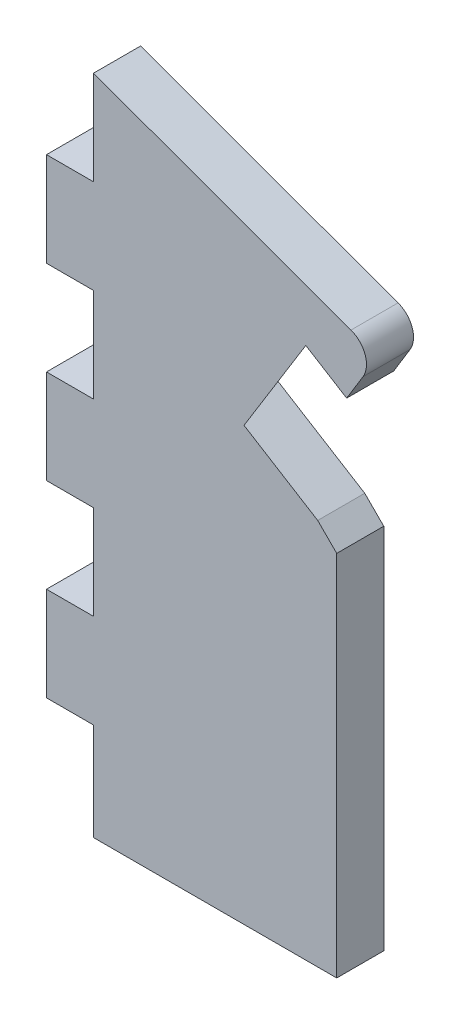
ISO-10303-21;
HEADER;
FILE_DESCRIPTION(('STEP AP214'),'2;1');
FILE_NAME('part.step','',(''),(''),'','','');
FILE_SCHEMA(('AUTOMOTIVE_DESIGN { 1 0 10303 214 1 1 1 1 }'));
ENDSEC;
DATA;
#1=APPLICATION_CONTEXT('core data for automotive mechanical design processes');
#2=APPLICATION_PROTOCOL_DEFINITION('international standard','automotive_design',2000,#1);
#3=PRODUCT_CONTEXT('',#1,'mechanical');
#4=PRODUCT('Part','Part','',(#3));
#5=PRODUCT_RELATED_PRODUCT_CATEGORY('part','',(#4));
#6=PRODUCT_DEFINITION_FORMATION('','',#4);
#7=PRODUCT_DEFINITION_CONTEXT('part definition',#1,'design');
#8=PRODUCT_DEFINITION('design','',#6,#7);
#9=PRODUCT_DEFINITION_SHAPE('','',#8);
#10=(LENGTH_UNIT() NAMED_UNIT(*) SI_UNIT(.MILLI.,.METRE.));
#11=(NAMED_UNIT(*) PLANE_ANGLE_UNIT() SI_UNIT($,.RADIAN.));
#12=(NAMED_UNIT(*) SI_UNIT($,.STERADIAN.) SOLID_ANGLE_UNIT());
#13=UNCERTAINTY_MEASURE_WITH_UNIT(LENGTH_MEASURE(1.E-05),#10,'distance_accuracy_value','');
#14=(GEOMETRIC_REPRESENTATION_CONTEXT(3) GLOBAL_UNCERTAINTY_ASSIGNED_CONTEXT((#13)) GLOBAL_UNIT_ASSIGNED_CONTEXT((#10,
#11,#12)) REPRESENTATION_CONTEXT('',''));
#15=CARTESIAN_POINT('',(0.,0.,0.));
#16=DIRECTION('',(0.,0.,1.));
#17=DIRECTION('',(1.,0.,0.));
#18=AXIS2_PLACEMENT_3D('',#15,#16,#17);
#19=CARTESIAN_POINT('',(0.,140.724589222245,0.));
#20=DIRECTION('',(0.,0.,-1.));
#21=DIRECTION('',(-1.,0.,0.));
#22=AXIS2_PLACEMENT_3D('',#19,#20,#21);
#23=PLANE('',#22);
#24=DIRECTION('',(0.525491223211028,0.850799021113787,0.));
#25=VECTOR('',#24,1.);
#26=CARTESIAN_POINT('',(52.2872206694648,114.912677761406,-8.88178419700125E-13));
#27=LINE('',#26,#25);
#28=CARTESIAN_POINT('',(39.1499400891891,93.6427022335608,-7.7715611723761E-13));
#29=VERTEX_POINT('',#28);
#30=CARTESIAN_POINT('',(52.2872206694648,114.912677761406,-8.88178419700125E-13));
#31=VERTEX_POINT('',#30);
#32=EDGE_CURVE('E209',#29,#31,#27,.T.);
#33=ORIENTED_EDGE('',*,*,#32,.F.);
#34=DIRECTION('',(0.850799021113789,-0.525491223211024,0.));
#35=VECTOR('',#34,1.);
#36=CARTESIAN_POINT('',(-10.238814691801,124.147388438719,0.));
#37=LINE('',#36,#35);
#38=CARTESIAN_POINT('',(57.6494479212947,82.216585420722,0.));
#39=VERTEX_POINT('',#38);
#40=EDGE_CURVE('E196',#29,#39,#37,.T.);
#41=ORIENTED_EDGE('',*,*,#40,.T.);
#42=DIRECTION('',(0.707192877761467,-0.707020674127324,0.));
#43=VECTOR('',#42,1.);
#44=CARTESIAN_POINT('',(31.1419879340853,108.717590760147,0.));
#45=LINE('',#44,#43);
#46=CARTESIAN_POINT('',(61.6966708086558,78.1703480445436,0.));
#47=VERTEX_POINT('',#46);
#48=EDGE_CURVE('E38',#39,#47,#45,.T.);
#49=ORIENTED_EDGE('',*,*,#48,.T.);
#50=DIRECTION('',(0.,-1.,0.));
#51=VECTOR('',#50,1.);
#52=CARTESIAN_POINT('',(61.6966708086558,78.1703480445436,0.));
#53=LINE('',#52,#51);
#54=CARTESIAN_POINT('',(61.6966708086558,0.,0.));
#55=VERTEX_POINT('',#54);
#56=EDGE_CURVE('E392',#47,#55,#53,.T.);
#57=ORIENTED_EDGE('',*,*,#56,.T.);
#58=DIRECTION('',(1.,0.,0.));
#59=VECTOR('',#58,1.);
#60=CARTESIAN_POINT('',(0.,0.,0.));
#61=LINE('',#60,#59);
#62=CARTESIAN_POINT('',(10.,0.,0.));
#63=VERTEX_POINT('',#62);
#64=EDGE_CURVE('E391',#55,#63,#61,.F.);
#65=ORIENTED_EDGE('',*,*,#64,.T.);
#66=DIRECTION('',(0.,-1.,0.));
#67=VECTOR('',#66,1.);
#68=CARTESIAN_POINT('',(10.,-73.1990088628228,0.));
#69=LINE('',#68,#67);
#70=CARTESIAN_POINT('',(10.,20.7245892222448,0.));
#71=VERTEX_POINT('',#70);
#72=EDGE_CURVE('E380',#71,#63,#69,.T.);
#73=ORIENTED_EDGE('',*,*,#72,.F.);
#74=DIRECTION('',(1.,0.,0.));
#75=VECTOR('',#74,1.);
#76=CARTESIAN_POINT('',(59.5721644797322,20.7245892222448,0.));
#77=LINE('',#76,#75);
#78=CARTESIAN_POINT('',(0.,20.7245892222448,0.));
#79=VERTEX_POINT('',#78);
#80=EDGE_CURVE('E370',#79,#71,#77,.T.);
#81=ORIENTED_EDGE('',*,*,#80,.F.);
#82=DIRECTION('',(0.,1.,0.));
#83=VECTOR('',#82,1.);
#84=CARTESIAN_POINT('',(0.,0.,0.));
#85=LINE('',#84,#83);
#86=CARTESIAN_POINT('',(0.,40.7245892222448,0.));
#87=VERTEX_POINT('',#86);
#88=EDGE_CURVE('E360',#79,#87,#85,.T.);
#89=ORIENTED_EDGE('',*,*,#88,.T.);
#90=DIRECTION('',(1.,0.,0.));
#91=VECTOR('',#90,1.);
#92=CARTESIAN_POINT('',(59.5721644797323,40.7245892222448,0.));
#93=LINE('',#92,#91);
#94=CARTESIAN_POINT('',(10.,40.7245892222448,0.));
#95=VERTEX_POINT('',#94);
#96=EDGE_CURVE('E339',#87,#95,#93,.T.);
#97=ORIENTED_EDGE('',*,*,#96,.T.);
#98=DIRECTION('',(0.,1.,0.));
#99=VECTOR('',#98,1.);
#100=CARTESIAN_POINT('',(10.,-73.1990088628228,0.));
#101=LINE('',#100,#99);
#102=CARTESIAN_POINT('',(10.,60.7245892222448,0.));
#103=VERTEX_POINT('',#102);
#104=EDGE_CURVE('E328',#95,#103,#101,.T.);
#105=ORIENTED_EDGE('',*,*,#104,.T.);
#106=DIRECTION('',(1.,0.,0.));
#107=VECTOR('',#106,1.);
#108=CARTESIAN_POINT('',(59.5721644797323,60.7245892222449,0.));
#109=LINE('',#108,#107);
#110=CARTESIAN_POINT('',(0.,60.7245892222449,0.));
#111=VERTEX_POINT('',#110);
#112=EDGE_CURVE('E317',#103,#111,#109,.F.);
#113=ORIENTED_EDGE('',*,*,#112,.T.);
#114=DIRECTION('',(0.,1.,0.));
#115=VECTOR('',#114,1.);
#116=CARTESIAN_POINT('',(0.,0.,0.));
#117=LINE('',#116,#115);
#118=CARTESIAN_POINT('',(0.,80.7245892222448,0.));
#119=VERTEX_POINT('',#118);
#120=EDGE_CURVE('E306',#111,#119,#117,.T.);
#121=ORIENTED_EDGE('',*,*,#120,.T.);
#122=DIRECTION('',(1.,0.,0.));
#123=VECTOR('',#122,1.);
#124=CARTESIAN_POINT('',(59.5721644797323,80.7245892222448,0.));
#125=LINE('',#124,#123);
#126=CARTESIAN_POINT('',(10.,80.7245892222448,0.));
#127=VERTEX_POINT('',#126);
#128=EDGE_CURVE('E295',#119,#127,#125,.T.);
#129=ORIENTED_EDGE('',*,*,#128,.T.);
#130=DIRECTION('',(0.,1.,0.));
#131=VECTOR('',#130,1.);
#132=CARTESIAN_POINT('',(10.,-73.1990088628228,0.));
#133=LINE('',#132,#131);
#134=CARTESIAN_POINT('',(10.,100.724589222245,0.));
#135=VERTEX_POINT('',#134);
#136=EDGE_CURVE('E284',#127,#135,#133,.T.);
#137=ORIENTED_EDGE('',*,*,#136,.T.);
#138=DIRECTION('',(1.,0.,0.));
#139=VECTOR('',#138,1.);
#140=CARTESIAN_POINT('',(59.5721644797323,100.724589222245,0.));
#141=LINE('',#140,#139);
#142=CARTESIAN_POINT('',(0.,100.724589222245,0.));
#143=VERTEX_POINT('',#142);
#144=EDGE_CURVE('E273',#135,#143,#141,.F.);
#145=ORIENTED_EDGE('',*,*,#144,.T.);
#146=DIRECTION('',(0.,1.,0.));
#147=VECTOR('',#146,1.);
#148=CARTESIAN_POINT('',(0.,0.,0.));
#149=LINE('',#148,#147);
#150=CARTESIAN_POINT('',(0.,120.724589222245,0.));
#151=VERTEX_POINT('',#150);
#152=EDGE_CURVE('E262',#143,#151,#149,.T.);
#153=ORIENTED_EDGE('',*,*,#152,.T.);
#154=DIRECTION('',(1.,0.,0.));
#155=VECTOR('',#154,1.);
#156=CARTESIAN_POINT('',(0.,120.724589222245,0.));
#157=LINE('',#156,#155);
#158=CARTESIAN_POINT('',(10.,120.724589222245,0.));
#159=VERTEX_POINT('',#158);
#160=EDGE_CURVE('E251',#151,#159,#157,.T.);
#161=ORIENTED_EDGE('',*,*,#160,.T.);
#162=DIRECTION('',(0.,1.,0.));
#163=VECTOR('',#162,1.);
#164=CARTESIAN_POINT('',(10.,120.724589222245,0.));
#165=LINE('',#164,#163);
#166=CARTESIAN_POINT('',(10.,140.724589222245,0.));
#167=VERTEX_POINT('',#166);
#168=EDGE_CURVE('E240',#159,#167,#165,.T.);
#169=ORIENTED_EDGE('',*,*,#168,.T.);
#170=DIRECTION('',(0.939692620785907,-0.342020143325673,0.));
#171=VECTOR('',#170,1.);
#172=CARTESIAN_POINT('',(10.,140.724589222245,0.));
#173=LINE('',#172,#171);
#174=CARTESIAN_POINT('',(64.7351319199746,120.80263043474,0.));
#175=VERTEX_POINT('',#174);
#176=EDGE_CURVE('E170',#167,#175,#173,.T.);
#177=ORIENTED_EDGE('',*,*,#176,.T.);
#178=CARTESIAN_POINT('',(63.0250312033463,116.10416733081,0.));
#179=DIRECTION('',(0.,0.,-1.));
#180=DIRECTION('',(-1.,0.,0.));
#181=AXIS2_PLACEMENT_3D('',#178,#179,#180);
#182=CIRCLE('',#181,5.);
#183=CARTESIAN_POINT('',(67.2907121341277,113.495725996073,0.));
#184=VERTEX_POINT('',#183);
#185=EDGE_CURVE('E228',#184,#175,#182,.F.);
#186=ORIENTED_EDGE('',*,*,#185,.F.);
#187=DIRECTION('',(0.521688266947523,0.853136186156285,0.));
#188=VECTOR('',#187,1.);
#189=CARTESIAN_POINT('',(61.0957440595671,103.364864768515,0.));
#190=LINE('',#189,#188);
#191=CARTESIAN_POINT('',(63.806497867019,107.797861083402,0.));
#192=VERTEX_POINT('',#191);
#193=EDGE_CURVE('E165',#192,#184,#190,.T.);
#194=ORIENTED_EDGE('',*,*,#193,.F.);
#195=DIRECTION('',(-0.850799021113788,0.525491223211026,0.));
#196=VECTOR('',#195,1.);
#197=CARTESIAN_POINT('',(2.8984658884747,145.417363966564,0.));
#198=LINE('',#197,#196);
#199=EDGE_CURVE('E51',#192,#31,#198,.T.);
#200=ORIENTED_EDGE('',*,*,#199,.T.);
#201=EDGE_LOOP('',(#33,#41,#49,#57,#65,#73,#81,#89,#97,#105,#113,#121,#129,#137,#145,#153,#161,
#169,#177,#186,#194,#200));
#202=FACE_BOUND('',#201,.T.);
#203=ADVANCED_FACE('F35',(#202),#23,.T.);
#204=CARTESIAN_POINT('',(31.1419879340853,108.717590760147,10.));
#205=DIRECTION('',(-0.707020674127324,-0.707192877761467,0.));
#206=DIRECTION('',(0.707192877761467,-0.707020674127324,0.));
#207=AXIS2_PLACEMENT_3D('',#204,#205,#206);
#208=PLANE('',#207);
#209=DIRECTION('',(0.,0.,-1.));
#210=VECTOR('',#209,1.);
#211=CARTESIAN_POINT('',(57.6494479212943,82.2165854207223,10.0000000000019));
#212=LINE('',#211,#210);
#213=CARTESIAN_POINT('',(57.6494479212947,82.2165854207221,10.));
#214=VERTEX_POINT('',#213);
#215=EDGE_CURVE('E202',#214,#39,#212,.T.);
#216=ORIENTED_EDGE('',*,*,#215,.F.);
#217=DIRECTION('',(0.707192877761465,-0.707020674127326,0.));
#218=VECTOR('',#217,1.);
#219=CARTESIAN_POINT('',(53.2103562755182,86.6545961340715,10.));
#220=LINE('',#219,#218);
#221=CARTESIAN_POINT('',(61.6966708086558,78.1703480445436,10.));
#222=VERTEX_POINT('',#221);
#223=EDGE_CURVE('E397',#214,#222,#220,.T.);
#224=ORIENTED_EDGE('',*,*,#223,.T.);
#225=DIRECTION('',(0.,0.,1.));
#226=VECTOR('',#225,1.);
#227=CARTESIAN_POINT('',(61.6966708086558,78.1703480445436,-140.));
#228=LINE('',#227,#226);
#229=EDGE_CURVE('E400',#222,#47,#228,.F.);
#230=ORIENTED_EDGE('',*,*,#229,.T.);
#231=ORIENTED_EDGE('',*,*,#48,.F.);
#232=EDGE_LOOP('',(#216,#224,#230,#231));
#233=FACE_BOUND('',#232,.T.);
#234=ADVANCED_FACE('F485',(#233),#208,.F.);
#235=CARTESIAN_POINT('',(0.,140.724589222245,10.));
#236=DIRECTION('',(0.,0.,-1.));
#237=DIRECTION('',(-1.,0.,0.));
#238=AXIS2_PLACEMENT_3D('',#235,#236,#237);
#239=PLANE('',#238);
#240=DIRECTION('',(0.850799021113789,-0.525491223211024,0.));
#241=VECTOR('',#240,1.);
#242=CARTESIAN_POINT('',(-10.238814691801,124.147388438719,10.));
#243=LINE('',#242,#241);
#244=CARTESIAN_POINT('',(41.9893254861997,91.8889718361172,9.99999999999999));
#245=VERTEX_POINT('',#244);
#246=EDGE_CURVE('E11',#245,#214,#243,.T.);
#247=ORIENTED_EDGE('',*,*,#246,.F.);
#248=DIRECTION('',(0.52549122321103,0.850799021113785,0.));
#249=VECTOR('',#248,1.);
#250=CARTESIAN_POINT('',(52.2281401780005,108.466172619643,10.));
#251=LINE('',#250,#249);
#252=CARTESIAN_POINT('',(55.1266060664754,113.158947363962,10.));
#253=VERTEX_POINT('',#252);
#254=EDGE_CURVE('E44',#245,#253,#251,.T.);
#255=ORIENTED_EDGE('',*,*,#254,.T.);
#256=DIRECTION('',(-0.850799021113788,0.525491223211026,0.));
#257=VECTOR('',#256,1.);
#258=CARTESIAN_POINT('',(2.89846588847473,145.417363966564,10.));
#259=LINE('',#258,#257);
#260=CARTESIAN_POINT('',(63.806497867019,107.797861083402,10.));
#261=VERTEX_POINT('',#260);
#262=EDGE_CURVE('E214',#261,#253,#259,.T.);
#263=ORIENTED_EDGE('',*,*,#262,.F.);
#264=DIRECTION('',(-0.521688266947523,-0.853136186156284,0.));
#265=VECTOR('',#264,1.);
#266=CARTESIAN_POINT('',(63.9257332048148,107.992851056892,10.));
#267=LINE('',#266,#265);
#268=CARTESIAN_POINT('',(67.2907121341277,113.495725996073,10.));
#269=VERTEX_POINT('',#268);
#270=EDGE_CURVE('E222',#269,#261,#267,.T.);
#271=ORIENTED_EDGE('',*,*,#270,.F.);
#272=CARTESIAN_POINT('',(63.0250312033463,116.10416733081,10.));
#273=DIRECTION('',(0.,0.,-1.));
#274=DIRECTION('',(1.,0.,0.));
#275=AXIS2_PLACEMENT_3D('',#272,#273,#274);
#276=CIRCLE('',#275,5.);
#277=CARTESIAN_POINT('',(64.7351319199746,120.80263043474,10.));
#278=VERTEX_POINT('',#277);
#279=EDGE_CURVE('E204',#278,#269,#276,.T.);
#280=ORIENTED_EDGE('',*,*,#279,.F.);
#281=DIRECTION('',(0.939692620785907,-0.342020143325672,0.));
#282=VECTOR('',#281,1.);
#283=CARTESIAN_POINT('',(10.,140.724589222245,10.));
#284=LINE('',#283,#282);
#285=CARTESIAN_POINT('',(10.,140.724589222245,10.));
#286=VERTEX_POINT('',#285);
#287=EDGE_CURVE('E233',#286,#278,#284,.T.);
#288=ORIENTED_EDGE('',*,*,#287,.F.);
#289=DIRECTION('',(0.,1.,0.));
#290=VECTOR('',#289,1.);
#291=CARTESIAN_POINT('',(10.,140.724589222245,10.));
#292=LINE('',#291,#290);
#293=CARTESIAN_POINT('',(10.,120.724589222245,10.));
#294=VERTEX_POINT('',#293);
#295=EDGE_CURVE('E236',#294,#286,#292,.T.);
#296=ORIENTED_EDGE('',*,*,#295,.F.);
#297=DIRECTION('',(-1.,0.,0.));
#298=VECTOR('',#297,1.);
#299=CARTESIAN_POINT('',(0.,120.724589222245,10.));
#300=LINE('',#299,#298);
#301=CARTESIAN_POINT('',(0.,120.724589222245,10.));
#302=VERTEX_POINT('',#301);
#303=EDGE_CURVE('E245',#302,#294,#300,.F.);
#304=ORIENTED_EDGE('',*,*,#303,.F.);
#305=DIRECTION('',(0.,1.,0.));
#306=VECTOR('',#305,1.);
#307=CARTESIAN_POINT('',(0.,140.724589222245,10.));
#308=LINE('',#307,#306);
#309=CARTESIAN_POINT('',(0.,100.724589222245,10.));
#310=VERTEX_POINT('',#309);
#311=EDGE_CURVE('E256',#310,#302,#308,.T.);
#312=ORIENTED_EDGE('',*,*,#311,.F.);
#313=DIRECTION('',(-1.,0.,0.));
#314=VECTOR('',#313,1.);
#315=CARTESIAN_POINT('',(0.,100.724589222245,10.));
#316=LINE('',#315,#314);
#317=CARTESIAN_POINT('',(10.,100.724589222245,10.));
#318=VERTEX_POINT('',#317);
#319=EDGE_CURVE('E267',#318,#310,#316,.T.);
#320=ORIENTED_EDGE('',*,*,#319,.F.);
#321=DIRECTION('',(0.,1.,0.));
#322=VECTOR('',#321,1.);
#323=CARTESIAN_POINT('',(10.,140.724589222245,10.));
#324=LINE('',#323,#322);
#325=CARTESIAN_POINT('',(10.,80.7245892222448,10.));
#326=VERTEX_POINT('',#325);
#327=EDGE_CURVE('E278',#326,#318,#324,.T.);
#328=ORIENTED_EDGE('',*,*,#327,.F.);
#329=DIRECTION('',(-1.,0.,0.));
#330=VECTOR('',#329,1.);
#331=CARTESIAN_POINT('',(0.,80.7245892222448,10.));
#332=LINE('',#331,#330);
#333=CARTESIAN_POINT('',(0.,80.7245892222448,10.));
#334=VERTEX_POINT('',#333);
#335=EDGE_CURVE('E289',#334,#326,#332,.F.);
#336=ORIENTED_EDGE('',*,*,#335,.F.);
#337=DIRECTION('',(0.,1.,0.));
#338=VECTOR('',#337,1.);
#339=CARTESIAN_POINT('',(0.,140.724589222245,10.));
#340=LINE('',#339,#338);
#341=CARTESIAN_POINT('',(0.,60.7245892222448,10.));
#342=VERTEX_POINT('',#341);
#343=EDGE_CURVE('E300',#342,#334,#340,.T.);
#344=ORIENTED_EDGE('',*,*,#343,.F.);
#345=DIRECTION('',(-1.,0.,0.));
#346=VECTOR('',#345,1.);
#347=CARTESIAN_POINT('',(0.,60.7245892222448,10.));
#348=LINE('',#347,#346);
#349=CARTESIAN_POINT('',(10.,60.7245892222448,10.));
#350=VERTEX_POINT('',#349);
#351=EDGE_CURVE('E311',#350,#342,#348,.T.);
#352=ORIENTED_EDGE('',*,*,#351,.F.);
#353=DIRECTION('',(0.,1.,0.));
#354=VECTOR('',#353,1.);
#355=CARTESIAN_POINT('',(10.,140.724589222245,10.));
#356=LINE('',#355,#354);
#357=CARTESIAN_POINT('',(10.,40.7245892222448,10.));
#358=VERTEX_POINT('',#357);
#359=EDGE_CURVE('E322',#358,#350,#356,.T.);
#360=ORIENTED_EDGE('',*,*,#359,.F.);
#361=DIRECTION('',(-1.,0.,0.));
#362=VECTOR('',#361,1.);
#363=CARTESIAN_POINT('',(0.,40.7245892222448,10.));
#364=LINE('',#363,#362);
#365=CARTESIAN_POINT('',(0.,40.7245892222448,10.));
#366=VERTEX_POINT('',#365);
#367=EDGE_CURVE('E333',#366,#358,#364,.F.);
#368=ORIENTED_EDGE('',*,*,#367,.F.);
#369=DIRECTION('',(0.,1.,0.));
#370=VECTOR('',#369,1.);
#371=CARTESIAN_POINT('',(0.,140.724589222245,10.));
#372=LINE('',#371,#370);
#373=CARTESIAN_POINT('',(0.,20.7245892222448,10.));
#374=VERTEX_POINT('',#373);
#375=EDGE_CURVE('E344',#374,#366,#372,.T.);
#376=ORIENTED_EDGE('',*,*,#375,.F.);
#377=DIRECTION('',(-1.,0.,0.));
#378=VECTOR('',#377,1.);
#379=CARTESIAN_POINT('',(0.,20.7245892222448,10.));
#380=LINE('',#379,#378);
#381=CARTESIAN_POINT('',(10.,20.7245892222448,10.));
#382=VERTEX_POINT('',#381);
#383=EDGE_CURVE('E355',#382,#374,#380,.T.);
#384=ORIENTED_EDGE('',*,*,#383,.F.);
#385=DIRECTION('',(0.,1.,0.));
#386=VECTOR('',#385,1.);
#387=CARTESIAN_POINT('',(10.,140.724589222245,10.));
#388=LINE('',#387,#386);
#389=CARTESIAN_POINT('',(10.,0.,10.));
#390=VERTEX_POINT('',#389);
#391=EDGE_CURVE('E365',#390,#382,#388,.T.);
#392=ORIENTED_EDGE('',*,*,#391,.F.);
#393=DIRECTION('',(-1.,0.,0.));
#394=VECTOR('',#393,1.);
#395=CARTESIAN_POINT('',(0.,0.,10.));
#396=LINE('',#395,#394);
#397=CARTESIAN_POINT('',(61.6966708086558,0.,10.));
#398=VERTEX_POINT('',#397);
#399=EDGE_CURVE('E375',#398,#390,#396,.T.);
#400=ORIENTED_EDGE('',*,*,#399,.F.);
#401=DIRECTION('',(0.,1.,0.));
#402=VECTOR('',#401,1.);
#403=CARTESIAN_POINT('',(61.6966708086558,140.724589222245,10.));
#404=LINE('',#403,#402);
#405=EDGE_CURVE('E385',#222,#398,#404,.F.);
#406=ORIENTED_EDGE('',*,*,#405,.F.);
#407=ORIENTED_EDGE('',*,*,#223,.F.);
#408=EDGE_LOOP('',(#247,#255,#263,#271,#280,#288,#296,#304,#312,#320,#328,#336,#344,#352,#360,
#368,#376,#384,#392,#400,#406,#407));
#409=FACE_BOUND('',#408,.T.);
#410=ADVANCED_FACE('F415',(#409),#239,.F.);
#411=CARTESIAN_POINT('',(63.9257332048148,107.992851056892,-20.));
#412=DIRECTION('',(-0.853136186156284,0.521688266947523,0.));
#413=DIRECTION('',(-0.521688266947523,-0.853136186156285,0.));
#414=AXIS2_PLACEMENT_3D('',#411,#412,#413);
#415=PLANE('',#414);
#416=DIRECTION('',(0.,0.,1.));
#417=VECTOR('',#416,1.);
#418=CARTESIAN_POINT('',(63.8064978670189,107.797861083402,-20.));
#419=LINE('',#418,#417);
#420=EDGE_CURVE('E235',#192,#261,#419,.T.);
#421=ORIENTED_EDGE('',*,*,#420,.F.);
#422=ORIENTED_EDGE('',*,*,#193,.T.);
#423=DIRECTION('',(0.,0.,1.));
#424=VECTOR('',#423,1.);
#425=CARTESIAN_POINT('',(67.2907121341277,113.495725996073,-20.));
#426=LINE('',#425,#424);
#427=EDGE_CURVE('E226',#184,#269,#426,.T.);
#428=ORIENTED_EDGE('',*,*,#427,.T.);
#429=ORIENTED_EDGE('',*,*,#270,.T.);
#430=EDGE_LOOP('',(#421,#422,#428,#429));
#431=FACE_BOUND('',#430,.T.);
#432=ADVANCED_FACE('F417',(#431),#415,.F.);
#433=CARTESIAN_POINT('',(61.6966708086558,78.1703480445436,-140.));
#434=DIRECTION('',(-1.,0.,0.));
#435=DIRECTION('',(0.,-1.,0.));
#436=AXIS2_PLACEMENT_3D('',#433,#434,#435);
#437=PLANE('',#436);
#438=ORIENTED_EDGE('',*,*,#229,.F.);
#439=ORIENTED_EDGE('',*,*,#405,.T.);
#440=DIRECTION('',(0.,0.,1.));
#441=VECTOR('',#440,1.);
#442=CARTESIAN_POINT('',(61.6966708086558,0.,10.));
#443=LINE('',#442,#441);
#444=EDGE_CURVE('E388',#398,#55,#443,.F.);
#445=ORIENTED_EDGE('',*,*,#444,.T.);
#446=ORIENTED_EDGE('',*,*,#56,.F.);
#447=EDGE_LOOP('',(#438,#439,#445,#446));
#448=FACE_BOUND('',#447,.T.);
#449=ADVANCED_FACE('F483',(#448),#437,.F.);
#450=CARTESIAN_POINT('',(0.,0.,10.));
#451=DIRECTION('',(0.,1.,0.));
#452=DIRECTION('',(0.,0.,1.));
#453=AXIS2_PLACEMENT_3D('',#450,#451,#452);
#454=PLANE('',#453);
#455=ORIENTED_EDGE('',*,*,#444,.F.);
#456=ORIENTED_EDGE('',*,*,#399,.T.);
#457=DIRECTION('',(0.,0.,1.));
#458=VECTOR('',#457,1.);
#459=CARTESIAN_POINT('',(10.,0.,0.));
#460=LINE('',#459,#458);
#461=EDGE_CURVE('E378',#63,#390,#460,.T.);
#462=ORIENTED_EDGE('',*,*,#461,.F.);
#463=ORIENTED_EDGE('',*,*,#64,.F.);
#464=EDGE_LOOP('',(#455,#456,#462,#463));
#465=FACE_BOUND('',#464,.T.);
#466=ADVANCED_FACE('F478',(#465),#454,.F.);
#467=CARTESIAN_POINT('',(10.,-73.1990088628228,0.));
#468=DIRECTION('',(-1.,0.,0.));
#469=DIRECTION('',(0.,-1.,0.));
#470=AXIS2_PLACEMENT_3D('',#467,#468,#469);
#471=PLANE('',#470);
#472=ORIENTED_EDGE('',*,*,#72,.T.);
#473=ORIENTED_EDGE('',*,*,#461,.T.);
#474=ORIENTED_EDGE('',*,*,#391,.T.);
#475=DIRECTION('',(0.,0.,1.));
#476=VECTOR('',#475,1.);
#477=CARTESIAN_POINT('',(10.,20.7245892222448,0.));
#478=LINE('',#477,#476);
#479=EDGE_CURVE('E368',#71,#382,#478,.T.);
#480=ORIENTED_EDGE('',*,*,#479,.F.);
#481=EDGE_LOOP('',(#472,#473,#474,#480));
#482=FACE_BOUND('',#481,.T.);
#483=ADVANCED_FACE('F473',(#482),#471,.T.);
#484=CARTESIAN_POINT('',(59.5721644797322,20.7245892222448,0.));
#485=DIRECTION('',(0.,-1.,0.));
#486=DIRECTION('',(1.,0.,0.));
#487=AXIS2_PLACEMENT_3D('',#484,#485,#486);
#488=PLANE('',#487);
#489=ORIENTED_EDGE('',*,*,#80,.T.);
#490=ORIENTED_EDGE('',*,*,#479,.T.);
#491=ORIENTED_EDGE('',*,*,#383,.T.);
#492=DIRECTION('',(0.,0.,-1.));
#493=VECTOR('',#492,1.);
#494=CARTESIAN_POINT('',(0.,20.7245892222448,10.));
#495=LINE('',#494,#493);
#496=EDGE_CURVE('E350',#374,#79,#495,.T.);
#497=ORIENTED_EDGE('',*,*,#496,.T.);
#498=EDGE_LOOP('',(#489,#490,#491,#497));
#499=FACE_BOUND('',#498,.T.);
#500=ADVANCED_FACE('F467',(#499),#488,.T.);
#501=CARTESIAN_POINT('',(0.,0.,10.));
#502=DIRECTION('',(1.,0.,0.));
#503=DIRECTION('',(0.,0.,-1.));
#504=AXIS2_PLACEMENT_3D('',#501,#502,#503);
#505=PLANE('',#504);
#506=ORIENTED_EDGE('',*,*,#375,.T.);
#507=DIRECTION('',(0.,0.,-1.));
#508=VECTOR('',#507,1.);
#509=CARTESIAN_POINT('',(0.,40.7245892222448,0.));
#510=LINE('',#509,#508);
#511=EDGE_CURVE('E347',#366,#87,#510,.T.);
#512=ORIENTED_EDGE('',*,*,#511,.T.);
#513=ORIENTED_EDGE('',*,*,#88,.F.);
#514=ORIENTED_EDGE('',*,*,#496,.F.);
#515=EDGE_LOOP('',(#506,#512,#513,#514));
#516=FACE_BOUND('',#515,.T.);
#517=ADVANCED_FACE('F464',(#516),#505,.F.);
#518=CARTESIAN_POINT('',(59.5721644797323,40.7245892222448,0.));
#519=DIRECTION('',(0.,-1.,0.));
#520=DIRECTION('',(0.,0.,-1.));
#521=AXIS2_PLACEMENT_3D('',#518,#519,#520);
#522=PLANE('',#521);
#523=DIRECTION('',(0.,0.,1.));
#524=VECTOR('',#523,1.);
#525=CARTESIAN_POINT('',(10.,40.7245892222448,0.));
#526=LINE('',#525,#524);
#527=EDGE_CURVE('E336',#358,#95,#526,.F.);
#528=ORIENTED_EDGE('',*,*,#527,.T.);
#529=ORIENTED_EDGE('',*,*,#96,.F.);
#530=ORIENTED_EDGE('',*,*,#511,.F.);
#531=ORIENTED_EDGE('',*,*,#367,.T.);
#532=EDGE_LOOP('',(#528,#529,#530,#531));
#533=FACE_BOUND('',#532,.T.);
#534=ADVANCED_FACE('F460',(#533),#522,.F.);
#535=CARTESIAN_POINT('',(10.,-73.1990088628228,0.));
#536=DIRECTION('',(1.,0.,0.));
#537=DIRECTION('',(0.,1.,0.));
#538=AXIS2_PLACEMENT_3D('',#535,#536,#537);
#539=PLANE('',#538);
#540=DIRECTION('',(0.,0.,1.));
#541=VECTOR('',#540,1.);
#542=CARTESIAN_POINT('',(10.,60.7245892222449,0.));
#543=LINE('',#542,#541);
#544=EDGE_CURVE('E325',#350,#103,#543,.F.);
#545=ORIENTED_EDGE('',*,*,#544,.T.);
#546=ORIENTED_EDGE('',*,*,#104,.F.);
#547=ORIENTED_EDGE('',*,*,#527,.F.);
#548=ORIENTED_EDGE('',*,*,#359,.T.);
#549=EDGE_LOOP('',(#545,#546,#547,#548));
#550=FACE_BOUND('',#549,.T.);
#551=ADVANCED_FACE('F456',(#550),#539,.F.);
#552=CARTESIAN_POINT('',(59.5721644797323,60.7245892222449,0.));
#553=DIRECTION('',(0.,1.,0.));
#554=DIRECTION('',(0.,0.,1.));
#555=AXIS2_PLACEMENT_3D('',#552,#553,#554);
#556=PLANE('',#555);
#557=DIRECTION('',(0.,0.,-1.));
#558=VECTOR('',#557,1.);
#559=CARTESIAN_POINT('',(0.,60.7245892222449,10.));
#560=LINE('',#559,#558);
#561=EDGE_CURVE('E314',#342,#111,#560,.T.);
#562=ORIENTED_EDGE('',*,*,#561,.T.);
#563=ORIENTED_EDGE('',*,*,#112,.F.);
#564=ORIENTED_EDGE('',*,*,#544,.F.);
#565=ORIENTED_EDGE('',*,*,#351,.T.);
#566=EDGE_LOOP('',(#562,#563,#564,#565));
#567=FACE_BOUND('',#566,.T.);
#568=ADVANCED_FACE('F452',(#567),#556,.F.);
#569=CARTESIAN_POINT('',(0.,0.,10.));
#570=DIRECTION('',(1.,0.,0.));
#571=DIRECTION('',(0.,0.,-1.));
#572=AXIS2_PLACEMENT_3D('',#569,#570,#571);
#573=PLANE('',#572);
#574=DIRECTION('',(0.,0.,-1.));
#575=VECTOR('',#574,1.);
#576=CARTESIAN_POINT('',(0.,80.7245892222448,0.));
#577=LINE('',#576,#575);
#578=EDGE_CURVE('E303',#334,#119,#577,.T.);
#579=ORIENTED_EDGE('',*,*,#578,.T.);
#580=ORIENTED_EDGE('',*,*,#120,.F.);
#581=ORIENTED_EDGE('',*,*,#561,.F.);
#582=ORIENTED_EDGE('',*,*,#343,.T.);
#583=EDGE_LOOP('',(#579,#580,#581,#582));
#584=FACE_BOUND('',#583,.T.);
#585=ADVANCED_FACE('F448',(#584),#573,.F.);
#586=CARTESIAN_POINT('',(59.5721644797323,80.7245892222448,0.));
#587=DIRECTION('',(0.,-1.,0.));
#588=DIRECTION('',(0.,0.,-1.));
#589=AXIS2_PLACEMENT_3D('',#586,#587,#588);
#590=PLANE('',#589);
#591=DIRECTION('',(0.,0.,1.));
#592=VECTOR('',#591,1.);
#593=CARTESIAN_POINT('',(10.,80.7245892222448,0.));
#594=LINE('',#593,#592);
#595=EDGE_CURVE('E292',#326,#127,#594,.F.);
#596=ORIENTED_EDGE('',*,*,#595,.T.);
#597=ORIENTED_EDGE('',*,*,#128,.F.);
#598=ORIENTED_EDGE('',*,*,#578,.F.);
#599=ORIENTED_EDGE('',*,*,#335,.T.);
#600=EDGE_LOOP('',(#596,#597,#598,#599));
#601=FACE_BOUND('',#600,.T.);
#602=ADVANCED_FACE('F444',(#601),#590,.F.);
#603=CARTESIAN_POINT('',(10.,-73.1990088628228,0.));
#604=DIRECTION('',(1.,0.,0.));
#605=DIRECTION('',(0.,1.,0.));
#606=AXIS2_PLACEMENT_3D('',#603,#604,#605);
#607=PLANE('',#606);
#608=DIRECTION('',(0.,0.,1.));
#609=VECTOR('',#608,1.);
#610=CARTESIAN_POINT('',(10.,100.724589222245,0.));
#611=LINE('',#610,#609);
#612=EDGE_CURVE('E281',#318,#135,#611,.F.);
#613=ORIENTED_EDGE('',*,*,#612,.T.);
#614=ORIENTED_EDGE('',*,*,#136,.F.);
#615=ORIENTED_EDGE('',*,*,#595,.F.);
#616=ORIENTED_EDGE('',*,*,#327,.T.);
#617=EDGE_LOOP('',(#613,#614,#615,#616));
#618=FACE_BOUND('',#617,.T.);
#619=ADVANCED_FACE('F440',(#618),#607,.F.);
#620=CARTESIAN_POINT('',(59.5721644797323,100.724589222245,0.));
#621=DIRECTION('',(0.,1.,0.));
#622=DIRECTION('',(0.,0.,1.));
#623=AXIS2_PLACEMENT_3D('',#620,#621,#622);
#624=PLANE('',#623);
#625=DIRECTION('',(0.,0.,-1.));
#626=VECTOR('',#625,1.);
#627=CARTESIAN_POINT('',(0.,100.724589222245,10.));
#628=LINE('',#627,#626);
#629=EDGE_CURVE('E270',#310,#143,#628,.T.);
#630=ORIENTED_EDGE('',*,*,#629,.T.);
#631=ORIENTED_EDGE('',*,*,#144,.F.);
#632=ORIENTED_EDGE('',*,*,#612,.F.);
#633=ORIENTED_EDGE('',*,*,#319,.T.);
#634=EDGE_LOOP('',(#630,#631,#632,#633));
#635=FACE_BOUND('',#634,.T.);
#636=ADVANCED_FACE('F436',(#635),#624,.F.);
#637=CARTESIAN_POINT('',(0.,0.,10.));
#638=DIRECTION('',(1.,0.,0.));
#639=DIRECTION('',(0.,0.,-1.));
#640=AXIS2_PLACEMENT_3D('',#637,#638,#639);
#641=PLANE('',#640);
#642=DIRECTION('',(0.,0.,-1.));
#643=VECTOR('',#642,1.);
#644=CARTESIAN_POINT('',(0.,120.724589222245,0.));
#645=LINE('',#644,#643);
#646=EDGE_CURVE('E259',#302,#151,#645,.T.);
#647=ORIENTED_EDGE('',*,*,#646,.T.);
#648=ORIENTED_EDGE('',*,*,#152,.F.);
#649=ORIENTED_EDGE('',*,*,#629,.F.);
#650=ORIENTED_EDGE('',*,*,#311,.T.);
#651=EDGE_LOOP('',(#647,#648,#649,#650));
#652=FACE_BOUND('',#651,.T.);
#653=ADVANCED_FACE('F432',(#652),#641,.F.);
#654=CARTESIAN_POINT('',(0.,120.724589222245,0.));
#655=DIRECTION('',(0.,-1.,0.));
#656=DIRECTION('',(0.,0.,-1.));
#657=AXIS2_PLACEMENT_3D('',#654,#655,#656);
#658=PLANE('',#657);
#659=DIRECTION('',(0.,0.,1.));
#660=VECTOR('',#659,1.);
#661=CARTESIAN_POINT('',(10.,120.724589222245,0.));
#662=LINE('',#661,#660);
#663=EDGE_CURVE('E248',#294,#159,#662,.F.);
#664=ORIENTED_EDGE('',*,*,#663,.T.);
#665=ORIENTED_EDGE('',*,*,#160,.F.);
#666=ORIENTED_EDGE('',*,*,#646,.F.);
#667=ORIENTED_EDGE('',*,*,#303,.T.);
#668=EDGE_LOOP('',(#664,#665,#666,#667));
#669=FACE_BOUND('',#668,.T.);
#670=ADVANCED_FACE('F428',(#669),#658,.F.);
#671=CARTESIAN_POINT('',(10.,120.724589222245,0.));
#672=DIRECTION('',(1.,0.,0.));
#673=DIRECTION('',(0.,1.,0.));
#674=AXIS2_PLACEMENT_3D('',#671,#672,#673);
#675=PLANE('',#674);
#676=DIRECTION('',(0.,0.,1.));
#677=VECTOR('',#676,1.);
#678=CARTESIAN_POINT('',(10.,140.724589222245,0.));
#679=LINE('',#678,#677);
#680=EDGE_CURVE('E60',#286,#167,#679,.F.);
#681=ORIENTED_EDGE('',*,*,#680,.T.);
#682=ORIENTED_EDGE('',*,*,#168,.F.);
#683=ORIENTED_EDGE('',*,*,#663,.F.);
#684=ORIENTED_EDGE('',*,*,#295,.T.);
#685=EDGE_LOOP('',(#681,#682,#683,#684));
#686=FACE_BOUND('',#685,.T.);
#687=ADVANCED_FACE('F424',(#686),#675,.F.);
#688=CARTESIAN_POINT('',(10.,140.724589222245,0.));
#689=DIRECTION('',(-0.342020143325673,-0.939692620785907,0.));
#690=DIRECTION('',(0.939692620785907,-0.342020143325673,0.));
#691=AXIS2_PLACEMENT_3D('',#688,#689,#690);
#692=PLANE('',#691);
#693=ORIENTED_EDGE('',*,*,#287,.T.);
#694=DIRECTION('',(0.,0.,1.));
#695=VECTOR('',#694,1.);
#696=CARTESIAN_POINT('',(64.7351319199746,120.80263043474,-20.));
#697=LINE('',#696,#695);
#698=EDGE_CURVE('E225',#175,#278,#697,.T.);
#699=ORIENTED_EDGE('',*,*,#698,.F.);
#700=ORIENTED_EDGE('',*,*,#176,.F.);
#701=ORIENTED_EDGE('',*,*,#680,.F.);
#702=EDGE_LOOP('',(#693,#699,#700,#701));
#703=FACE_BOUND('',#702,.T.);
#704=ADVANCED_FACE('F523',(#703),#692,.F.);
#705=CARTESIAN_POINT('',(63.0250312033463,116.10416733081,-20.));
#706=DIRECTION('',(0.,0.,1.));
#707=DIRECTION('',(1.,0.,0.));
#708=AXIS2_PLACEMENT_3D('',#705,#706,#707);
#709=CYLINDRICAL_SURFACE('',#708,5.);
#710=ORIENTED_EDGE('',*,*,#185,.T.);
#711=ORIENTED_EDGE('',*,*,#698,.T.);
#712=ORIENTED_EDGE('',*,*,#279,.T.);
#713=ORIENTED_EDGE('',*,*,#427,.F.);
#714=EDGE_LOOP('',(#710,#711,#712,#713));
#715=FACE_BOUND('',#714,.T.);
#716=ADVANCED_FACE('F419',(#715),#709,.T.);
#717=CARTESIAN_POINT('',(-12.1717841681259,7.5178339330902,4.77446401139312));
#718=DIRECTION('',(-0.807042338059232,0.498465154384701,0.31656777227653));
#719=DIRECTION('',(-0.52549122321103,-0.850799021113785,0.));
#720=AXIS2_PLACEMENT_3D('',#717,#718,#719);
#721=PLANE('',#720);
#722=DIRECTION('',(-0.269335550769049,0.166353585882773,-0.948569894923867));
#723=VECTOR('',#722,1.);
#724=CARTESIAN_POINT('',(39.1499400891891,93.6427022335608,-7.7715611723761E-13));
#725=LINE('',#724,#723);
#726=EDGE_CURVE('E199',#245,#29,#725,.T.);
#727=ORIENTED_EDGE('',*,*,#726,.T.);
#728=ORIENTED_EDGE('',*,*,#32,.T.);
#729=DIRECTION('',(0.269335550769047,-0.166353585882778,0.948569894923866));
#730=VECTOR('',#729,1.);
#731=CARTESIAN_POINT('',(59.6461931130443,110.367449881512,25.9174835910886));
#732=LINE('',#731,#730);
#733=EDGE_CURVE('E212',#31,#253,#732,.T.);
#734=ORIENTED_EDGE('',*,*,#733,.T.);
#735=ORIENTED_EDGE('',*,*,#254,.F.);
#736=EDGE_LOOP('',(#727,#728,#734,#735));
#737=FACE_BOUND('',#736,.T.);
#738=ADVANCED_FACE('F207',(#737),#721,.F.);
#739=CARTESIAN_POINT('',(71.4316336115584,73.7040960581729,-12.662710891062));
#740=DIRECTION('',(0.525491223211024,0.850799021113789,0.));
#741=DIRECTION('',(-0.850799021113789,0.525491223211024,0.));
#742=AXIS2_PLACEMENT_3D('',#739,#740,#741);
#743=PLANE('',#742);
#744=ORIENTED_EDGE('',*,*,#726,.F.);
#745=ORIENTED_EDGE('',*,*,#246,.T.);
#746=ORIENTED_EDGE('',*,*,#215,.T.);
#747=ORIENTED_EDGE('',*,*,#40,.F.);
#748=EDGE_LOOP('',(#744,#745,#746,#747));
#749=FACE_BOUND('',#748,.T.);
#750=ADVANCED_FACE('F198',(#749),#743,.T.);
#751=CARTESIAN_POINT('',(91.9278866354137,90.4288437061239,13.2547727000274));
#752=DIRECTION('',(-0.525491223211026,-0.850799021113788,0.));
#753=DIRECTION('',(0.850799021113788,-0.525491223211026,0.));
#754=AXIS2_PLACEMENT_3D('',#751,#752,#753);
#755=PLANE('',#754);
#756=ORIENTED_EDGE('',*,*,#420,.T.);
#757=ORIENTED_EDGE('',*,*,#262,.T.);
#758=ORIENTED_EDGE('',*,*,#733,.F.);
#759=ORIENTED_EDGE('',*,*,#199,.F.);
#760=EDGE_LOOP('',(#756,#757,#758,#759));
#761=FACE_BOUND('',#760,.T.);
#762=ADVANCED_FACE('F413',(#761),#755,.T.);
#763=CLOSED_SHELL('',(#203,#234,#410,#432,#449,#466,#483,#500,#517,#534,#551,#568,#585,#602,
#619,#636,#653,#670,#687,#704,#716,#738,#750,#762));
#764=MANIFOLD_SOLID_BREP('B2',#763);
#765=ADVANCED_BREP_SHAPE_REPRESENTATION('',(#18,#764),#14);
#766=SHAPE_DEFINITION_REPRESENTATION(#9,#765);
ENDSEC;
END-ISO-10303-21;
